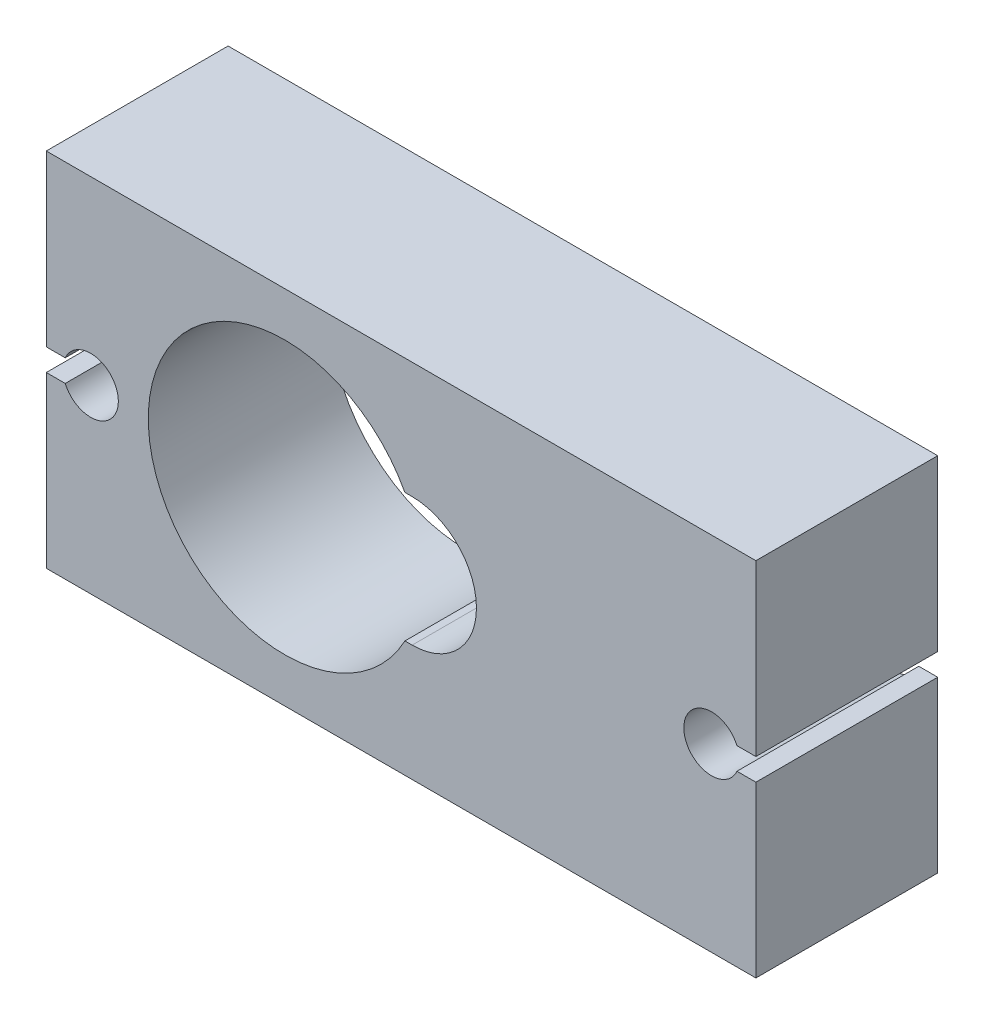
ISO-10303-21;
HEADER;
FILE_DESCRIPTION(('STEP AP214'),'2;1');
FILE_NAME('part.step','',(''),(''),'','','');
FILE_SCHEMA(('AUTOMOTIVE_DESIGN { 1 0 10303 214 1 1 1 1 }'));
ENDSEC;
DATA;
#1=APPLICATION_CONTEXT('core data for automotive mechanical design processes');
#2=APPLICATION_PROTOCOL_DEFINITION('international standard','automotive_design',2000,#1);
#3=PRODUCT_CONTEXT('',#1,'mechanical');
#4=PRODUCT('Part','Part','',(#3));
#5=PRODUCT_RELATED_PRODUCT_CATEGORY('part','',(#4));
#6=PRODUCT_DEFINITION_FORMATION('','',#4);
#7=PRODUCT_DEFINITION_CONTEXT('part definition',#1,'design');
#8=PRODUCT_DEFINITION('design','',#6,#7);
#9=PRODUCT_DEFINITION_SHAPE('','',#8);
#10=(LENGTH_UNIT() NAMED_UNIT(*) SI_UNIT(.MILLI.,.METRE.));
#11=(NAMED_UNIT(*) PLANE_ANGLE_UNIT() SI_UNIT($,.RADIAN.));
#12=(NAMED_UNIT(*) SI_UNIT($,.STERADIAN.) SOLID_ANGLE_UNIT());
#13=UNCERTAINTY_MEASURE_WITH_UNIT(LENGTH_MEASURE(1.E-05),#10,'distance_accuracy_value','');
#14=(GEOMETRIC_REPRESENTATION_CONTEXT(3) GLOBAL_UNCERTAINTY_ASSIGNED_CONTEXT((#13)) GLOBAL_UNIT_ASSIGNED_CONTEXT((#10,
#11,#12)) REPRESENTATION_CONTEXT('',''));
#15=CARTESIAN_POINT('',(0.,0.,0.));
#16=DIRECTION('',(0.,0.,1.));
#17=DIRECTION('',(1.,0.,0.));
#18=AXIS2_PLACEMENT_3D('',#15,#16,#17);
#19=CARTESIAN_POINT('',(-25.,5.74803322038159,8.2));
#20=DIRECTION('',(0.,0.,1.));
#21=DIRECTION('',(1.,0.,0.));
#22=AXIS2_PLACEMENT_3D('',#19,#20,#21);
#23=PLANE('',#22);
#24=CARTESIAN_POINT('',(-25.,5.74803322038159,8.2));
#25=DIRECTION('',(0.,0.,-1.));
#26=DIRECTION('',(1.,0.,0.));
#27=AXIS2_PLACEMENT_3D('',#24,#25,#26);
#28=CIRCLE('',#27,1.25);
#29=CARTESIAN_POINT('',(-26.145643923739,6.24803322038159,8.2));
#30=VERTEX_POINT('',#29);
#31=CARTESIAN_POINT('',(-26.145643923739,5.24803322038159,8.2));
#32=VERTEX_POINT('',#31);
#33=EDGE_CURVE('E182',#30,#32,#28,.T.);
#34=ORIENTED_EDGE('',*,*,#33,.T.);
#35=DIRECTION('',(-1.,0.,0.));
#36=VECTOR('',#35,1.);
#37=CARTESIAN_POINT('',(-26.145643923739,5.24803322038159,8.2));
#38=LINE('',#37,#36);
#39=CARTESIAN_POINT('',(-27.,5.24803322038159,8.2));
#40=VERTEX_POINT('',#39);
#41=EDGE_CURVE('E185',#32,#40,#38,.T.);
#42=ORIENTED_EDGE('',*,*,#41,.T.);
#43=DIRECTION('',(0.,-1.,0.));
#44=VECTOR('',#43,1.);
#45=CARTESIAN_POINT('',(-27.,5.24803322038159,8.2));
#46=LINE('',#45,#44);
#47=CARTESIAN_POINT('',(-27.,-2.4,8.2));
#48=VERTEX_POINT('',#47);
#49=EDGE_CURVE('E188',#40,#48,#46,.T.);
#50=ORIENTED_EDGE('',*,*,#49,.T.);
#51=DIRECTION('',(1.,0.,0.));
#52=VECTOR('',#51,1.);
#53=CARTESIAN_POINT('',(5.00280982172673,-2.4,8.2));
#54=LINE('',#53,#52);
#55=CARTESIAN_POINT('',(5.00280982172673,-2.4,8.2));
#56=VERTEX_POINT('',#55);
#57=EDGE_CURVE('E190',#48,#56,#54,.T.);
#58=ORIENTED_EDGE('',*,*,#57,.T.);
#59=DIRECTION('',(0.,1.,0.));
#60=VECTOR('',#59,1.);
#61=CARTESIAN_POINT('',(5.00280982172673,5.24803322038159,8.2));
#62=LINE('',#61,#60);
#63=CARTESIAN_POINT('',(5.00280982172673,5.24803322038159,8.2));
#64=VERTEX_POINT('',#63);
#65=EDGE_CURVE('E192',#56,#64,#62,.T.);
#66=ORIENTED_EDGE('',*,*,#65,.T.);
#67=DIRECTION('',(-1.,0.,0.));
#68=VECTOR('',#67,1.);
#69=CARTESIAN_POINT('',(5.00280982172673,5.24803322038159,8.2));
#70=LINE('',#69,#68);
#71=CARTESIAN_POINT('',(4.14845374546569,5.24803322038159,8.2));
#72=VERTEX_POINT('',#71);
#73=EDGE_CURVE('E194',#64,#72,#70,.T.);
#74=ORIENTED_EDGE('',*,*,#73,.T.);
#75=CARTESIAN_POINT('',(3.00280982172673,5.74803322038159,8.2));
#76=DIRECTION('',(0.,0.,-1.));
#77=DIRECTION('',(1.,0.,0.));
#78=AXIS2_PLACEMENT_3D('',#75,#76,#77);
#79=CIRCLE('',#78,1.25);
#80=CARTESIAN_POINT('',(4.14845374546569,6.24803322038159,8.2));
#81=VERTEX_POINT('',#80);
#82=EDGE_CURVE('E196',#72,#81,#79,.T.);
#83=ORIENTED_EDGE('',*,*,#82,.T.);
#84=DIRECTION('',(1.,0.,0.));
#85=VECTOR('',#84,1.);
#86=CARTESIAN_POINT('',(4.14845374546569,6.24803322038159,8.2));
#87=LINE('',#86,#85);
#88=CARTESIAN_POINT('',(5.00280982172672,6.24803322038159,8.2));
#89=VERTEX_POINT('',#88);
#90=EDGE_CURVE('E198',#81,#89,#87,.T.);
#91=ORIENTED_EDGE('',*,*,#90,.T.);
#92=DIRECTION('',(0.,1.,0.));
#93=VECTOR('',#92,1.);
#94=CARTESIAN_POINT('',(5.00280982172672,13.9,8.2));
#95=LINE('',#94,#93);
#96=CARTESIAN_POINT('',(5.00280982172672,13.9,8.2));
#97=VERTEX_POINT('',#96);
#98=EDGE_CURVE('E200',#89,#97,#95,.T.);
#99=ORIENTED_EDGE('',*,*,#98,.T.);
#100=DIRECTION('',(-1.,0.,0.));
#101=VECTOR('',#100,1.);
#102=CARTESIAN_POINT('',(-27.,13.9,8.2));
#103=LINE('',#102,#101);
#104=CARTESIAN_POINT('',(-27.,13.9,8.2));
#105=VERTEX_POINT('',#104);
#106=EDGE_CURVE('E202',#97,#105,#103,.T.);
#107=ORIENTED_EDGE('',*,*,#106,.T.);
#108=DIRECTION('',(0.,-1.,0.));
#109=VECTOR('',#108,1.);
#110=CARTESIAN_POINT('',(-27.,13.9,8.2));
#111=LINE('',#110,#109);
#112=CARTESIAN_POINT('',(-27.,6.24803322038159,8.2));
#113=VERTEX_POINT('',#112);
#114=EDGE_CURVE('E204',#105,#113,#111,.T.);
#115=ORIENTED_EDGE('',*,*,#114,.T.);
#116=DIRECTION('',(1.,0.,0.));
#117=VECTOR('',#116,1.);
#118=CARTESIAN_POINT('',(-27.,6.24803322038159,8.2));
#119=LINE('',#118,#117);
#120=EDGE_CURVE('E206',#113,#30,#119,.T.);
#121=ORIENTED_EDGE('',*,*,#120,.T.);
#122=EDGE_LOOP('',(#34,#42,#50,#58,#66,#74,#83,#91,#99,#107,#115,#121));
#123=FACE_BOUND('',#122,.T.);
#124=DIRECTION('',(-1.,0.,0.));
#125=VECTOR('',#124,1.);
#126=CARTESIAN_POINT('',(-10.5,8.65,8.2));
#127=LINE('',#126,#125);
#128=CARTESIAN_POINT('',(-10.5,8.65,8.2));
#129=VERTEX_POINT('',#128);
#130=CARTESIAN_POINT('',(-10.8266707641892,8.65,8.2));
#131=VERTEX_POINT('',#130);
#132=EDGE_CURVE('E154',#129,#131,#127,.T.);
#133=ORIENTED_EDGE('',*,*,#132,.F.);
#134=CARTESIAN_POINT('',(-10.5,5.75,8.2));
#135=DIRECTION('',(0.,0.,1.));
#136=DIRECTION('',(1.,0.,0.));
#137=AXIS2_PLACEMENT_3D('',#134,#135,#136);
#138=CIRCLE('',#137,2.9);
#139=CARTESIAN_POINT('',(-10.5,2.85,8.2));
#140=VERTEX_POINT('',#139);
#141=EDGE_CURVE('E146',#140,#129,#138,.T.);
#142=ORIENTED_EDGE('',*,*,#141,.F.);
#143=DIRECTION('',(1.,0.,0.));
#144=VECTOR('',#143,1.);
#145=CARTESIAN_POINT('',(-10.8266707641892,2.85,8.2));
#146=LINE('',#145,#144);
#147=CARTESIAN_POINT('',(-10.8266707641892,2.85,8.2));
#148=VERTEX_POINT('',#147);
#149=EDGE_CURVE('E168',#148,#140,#146,.T.);
#150=ORIENTED_EDGE('',*,*,#149,.F.);
#151=CARTESIAN_POINT('',(-16.25,5.75,8.2));
#152=DIRECTION('',(0.,0.,1.));
#153=DIRECTION('',(1.,0.,0.));
#154=AXIS2_PLACEMENT_3D('',#151,#152,#153);
#155=CIRCLE('',#154,6.15);
#156=EDGE_CURVE('E166',#131,#148,#155,.T.);
#157=ORIENTED_EDGE('',*,*,#156,.F.);
#158=EDGE_LOOP('',(#133,#142,#150,#157));
#159=FACE_BOUND('',#158,.T.);
#160=ADVANCED_FACE('F33',(#123,#159),#23,.T.);
#161=CARTESIAN_POINT('',(-25.,5.74803322038159,0.));
#162=DIRECTION('',(0.,0.,1.));
#163=DIRECTION('',(1.,0.,0.));
#164=AXIS2_PLACEMENT_3D('',#161,#162,#163);
#165=PLANE('',#164);
#166=CARTESIAN_POINT('',(-25.,5.74803322038159,0.));
#167=DIRECTION('',(0.,0.,-1.));
#168=DIRECTION('',(1.,0.,0.));
#169=AXIS2_PLACEMENT_3D('',#166,#167,#168);
#170=CIRCLE('',#169,1.25);
#171=CARTESIAN_POINT('',(-26.145643923739,6.24803322038159,0.));
#172=VERTEX_POINT('',#171);
#173=CARTESIAN_POINT('',(-26.145643923739,5.24803322038159,0.));
#174=VERTEX_POINT('',#173);
#175=EDGE_CURVE('E162',#172,#174,#170,.T.);
#176=ORIENTED_EDGE('',*,*,#175,.F.);
#177=DIRECTION('',(1.,0.,0.));
#178=VECTOR('',#177,1.);
#179=CARTESIAN_POINT('',(-27.,6.24803322038159,0.));
#180=LINE('',#179,#178);
#181=CARTESIAN_POINT('',(-27.,6.24803322038159,0.));
#182=VERTEX_POINT('',#181);
#183=EDGE_CURVE('E186',#182,#172,#180,.T.);
#184=ORIENTED_EDGE('',*,*,#183,.F.);
#185=DIRECTION('',(0.,-1.,0.));
#186=VECTOR('',#185,1.);
#187=CARTESIAN_POINT('',(-27.,13.9,0.));
#188=LINE('',#187,#186);
#189=CARTESIAN_POINT('',(-27.,13.9,0.));
#190=VERTEX_POINT('',#189);
#191=EDGE_CURVE('E229',#190,#182,#188,.T.);
#192=ORIENTED_EDGE('',*,*,#191,.F.);
#193=DIRECTION('',(-1.,0.,0.));
#194=VECTOR('',#193,1.);
#195=CARTESIAN_POINT('',(-27.,13.9,0.));
#196=LINE('',#195,#194);
#197=CARTESIAN_POINT('',(5.00280982172672,13.9,0.));
#198=VERTEX_POINT('',#197);
#199=EDGE_CURVE('E227',#198,#190,#196,.T.);
#200=ORIENTED_EDGE('',*,*,#199,.F.);
#201=DIRECTION('',(0.,1.,0.));
#202=VECTOR('',#201,1.);
#203=CARTESIAN_POINT('',(5.00280982172672,13.9,0.));
#204=LINE('',#203,#202);
#205=CARTESIAN_POINT('',(5.00280982172672,6.24803322038159,0.));
#206=VERTEX_POINT('',#205);
#207=EDGE_CURVE('E225',#206,#198,#204,.T.);
#208=ORIENTED_EDGE('',*,*,#207,.F.);
#209=DIRECTION('',(1.,0.,0.));
#210=VECTOR('',#209,1.);
#211=CARTESIAN_POINT('',(4.14845374546569,6.24803322038159,0.));
#212=LINE('',#211,#210);
#213=CARTESIAN_POINT('',(4.14845374546569,6.24803322038159,0.));
#214=VERTEX_POINT('',#213);
#215=EDGE_CURVE('E223',#214,#206,#212,.T.);
#216=ORIENTED_EDGE('',*,*,#215,.F.);
#217=CARTESIAN_POINT('',(3.00280982172673,5.74803322038159,0.));
#218=DIRECTION('',(0.,0.,-1.));
#219=DIRECTION('',(1.,0.,0.));
#220=AXIS2_PLACEMENT_3D('',#217,#218,#219);
#221=CIRCLE('',#220,1.25);
#222=CARTESIAN_POINT('',(4.14845374546569,5.24803322038159,0.));
#223=VERTEX_POINT('',#222);
#224=EDGE_CURVE('E221',#223,#214,#221,.T.);
#225=ORIENTED_EDGE('',*,*,#224,.F.);
#226=DIRECTION('',(-1.,0.,0.));
#227=VECTOR('',#226,1.);
#228=CARTESIAN_POINT('',(5.00280982172673,5.24803322038159,0.));
#229=LINE('',#228,#227);
#230=CARTESIAN_POINT('',(5.00280982172673,5.24803322038159,0.));
#231=VERTEX_POINT('',#230);
#232=EDGE_CURVE('E219',#231,#223,#229,.T.);
#233=ORIENTED_EDGE('',*,*,#232,.F.);
#234=DIRECTION('',(0.,1.,0.));
#235=VECTOR('',#234,1.);
#236=CARTESIAN_POINT('',(5.00280982172673,5.24803322038159,0.));
#237=LINE('',#236,#235);
#238=CARTESIAN_POINT('',(5.00280982172673,-2.4,0.));
#239=VERTEX_POINT('',#238);
#240=EDGE_CURVE('E217',#239,#231,#237,.T.);
#241=ORIENTED_EDGE('',*,*,#240,.F.);
#242=DIRECTION('',(1.,0.,0.));
#243=VECTOR('',#242,1.);
#244=CARTESIAN_POINT('',(5.00280982172673,-2.4,0.));
#245=LINE('',#244,#243);
#246=CARTESIAN_POINT('',(-27.,-2.4,0.));
#247=VERTEX_POINT('',#246);
#248=EDGE_CURVE('E215',#247,#239,#245,.T.);
#249=ORIENTED_EDGE('',*,*,#248,.F.);
#250=DIRECTION('',(0.,-1.,0.));
#251=VECTOR('',#250,1.);
#252=CARTESIAN_POINT('',(-27.,5.24803322038159,0.));
#253=LINE('',#252,#251);
#254=CARTESIAN_POINT('',(-27.,5.24803322038159,0.));
#255=VERTEX_POINT('',#254);
#256=EDGE_CURVE('E213',#255,#247,#253,.T.);
#257=ORIENTED_EDGE('',*,*,#256,.F.);
#258=DIRECTION('',(-1.,0.,0.));
#259=VECTOR('',#258,1.);
#260=CARTESIAN_POINT('',(-26.145643923739,5.24803322038159,0.));
#261=LINE('',#260,#259);
#262=EDGE_CURVE('E211',#174,#255,#261,.T.);
#263=ORIENTED_EDGE('',*,*,#262,.F.);
#264=EDGE_LOOP('',(#176,#184,#192,#200,#208,#216,#225,#233,#241,#249,#257,#263));
#265=FACE_BOUND('',#264,.T.);
#266=CARTESIAN_POINT('',(-10.5,5.75,0.));
#267=DIRECTION('',(0.,0.,1.));
#268=DIRECTION('',(1.,0.,0.));
#269=AXIS2_PLACEMENT_3D('',#266,#267,#268);
#270=CIRCLE('',#269,2.9);
#271=CARTESIAN_POINT('',(-10.5,2.85,0.));
#272=VERTEX_POINT('',#271);
#273=CARTESIAN_POINT('',(-10.5,8.65,0.));
#274=VERTEX_POINT('',#273);
#275=EDGE_CURVE('E56',#272,#274,#270,.T.);
#276=ORIENTED_EDGE('',*,*,#275,.T.);
#277=DIRECTION('',(-1.,0.,0.));
#278=VECTOR('',#277,1.);
#279=CARTESIAN_POINT('',(-10.5,8.65,0.));
#280=LINE('',#279,#278);
#281=CARTESIAN_POINT('',(-10.8266707641892,8.65,0.));
#282=VERTEX_POINT('',#281);
#283=EDGE_CURVE('E161',#274,#282,#280,.T.);
#284=ORIENTED_EDGE('',*,*,#283,.T.);
#285=CARTESIAN_POINT('',(-16.25,5.75,0.));
#286=DIRECTION('',(0.,0.,1.));
#287=DIRECTION('',(1.,0.,0.));
#288=AXIS2_PLACEMENT_3D('',#285,#286,#287);
#289=CIRCLE('',#288,6.15);
#290=CARTESIAN_POINT('',(-10.8266707641892,2.85,0.));
#291=VERTEX_POINT('',#290);
#292=EDGE_CURVE('E174',#282,#291,#289,.T.);
#293=ORIENTED_EDGE('',*,*,#292,.T.);
#294=DIRECTION('',(1.,0.,0.));
#295=VECTOR('',#294,1.);
#296=CARTESIAN_POINT('',(-10.8266707641892,2.85,0.));
#297=LINE('',#296,#295);
#298=EDGE_CURVE('E155',#291,#272,#297,.T.);
#299=ORIENTED_EDGE('',*,*,#298,.T.);
#300=EDGE_LOOP('',(#276,#284,#293,#299));
#301=FACE_BOUND('',#300,.T.);
#302=ADVANCED_FACE('F271',(#265,#301),#165,.F.);
#303=CARTESIAN_POINT('',(-25.,5.74803322038159,8.2));
#304=DIRECTION('',(0.,0.,-1.));
#305=DIRECTION('',(-1.,0.,0.));
#306=AXIS2_PLACEMENT_3D('',#303,#304,#305);
#307=CYLINDRICAL_SURFACE('',#306,1.25);
#308=ORIENTED_EDGE('',*,*,#175,.T.);
#309=DIRECTION('',(0.,0.,-1.));
#310=VECTOR('',#309,1.);
#311=CARTESIAN_POINT('',(-26.145643923739,5.24803322038159,8.2));
#312=LINE('',#311,#310);
#313=EDGE_CURVE('E11',#32,#174,#312,.T.);
#314=ORIENTED_EDGE('',*,*,#313,.F.);
#315=ORIENTED_EDGE('',*,*,#33,.F.);
#316=DIRECTION('',(0.,0.,-1.));
#317=VECTOR('',#316,1.);
#318=CARTESIAN_POINT('',(-26.145643923739,6.24803322038159,8.2));
#319=LINE('',#318,#317);
#320=EDGE_CURVE('E208',#30,#172,#319,.T.);
#321=ORIENTED_EDGE('',*,*,#320,.T.);
#322=EDGE_LOOP('',(#308,#314,#315,#321));
#323=FACE_BOUND('',#322,.T.);
#324=ADVANCED_FACE('F35',(#323),#307,.F.);
#325=CARTESIAN_POINT('',(-26.145643923739,5.24803322038159,8.2));
#326=DIRECTION('',(0.,-1.,0.));
#327=DIRECTION('',(0.,0.,-1.));
#328=AXIS2_PLACEMENT_3D('',#325,#326,#327);
#329=PLANE('',#328);
#330=ORIENTED_EDGE('',*,*,#262,.T.);
#331=DIRECTION('',(0.,0.,-1.));
#332=VECTOR('',#331,1.);
#333=CARTESIAN_POINT('',(-27.,5.24803322038159,8.2));
#334=LINE('',#333,#332);
#335=EDGE_CURVE('E41',#40,#255,#334,.T.);
#336=ORIENTED_EDGE('',*,*,#335,.F.);
#337=ORIENTED_EDGE('',*,*,#41,.F.);
#338=ORIENTED_EDGE('',*,*,#313,.T.);
#339=EDGE_LOOP('',(#330,#336,#337,#338));
#340=FACE_BOUND('',#339,.T.);
#341=ADVANCED_FACE('F288',(#340),#329,.F.);
#342=CARTESIAN_POINT('',(-27.,5.24803322038159,8.2));
#343=DIRECTION('',(1.,0.,0.));
#344=DIRECTION('',(0.,0.,-1.));
#345=AXIS2_PLACEMENT_3D('',#342,#343,#344);
#346=PLANE('',#345);
#347=ORIENTED_EDGE('',*,*,#256,.T.);
#348=DIRECTION('',(0.,0.,-1.));
#349=VECTOR('',#348,1.);
#350=CARTESIAN_POINT('',(-27.,-2.4,8.2));
#351=LINE('',#350,#349);
#352=EDGE_CURVE('E258',#48,#247,#351,.T.);
#353=ORIENTED_EDGE('',*,*,#352,.F.);
#354=ORIENTED_EDGE('',*,*,#49,.F.);
#355=ORIENTED_EDGE('',*,*,#335,.T.);
#356=EDGE_LOOP('',(#347,#353,#354,#355));
#357=FACE_BOUND('',#356,.T.);
#358=ADVANCED_FACE('F265',(#357),#346,.F.);
#359=CARTESIAN_POINT('',(5.00280982172673,-2.4,8.2));
#360=DIRECTION('',(0.,1.,0.));
#361=DIRECTION('',(-1.,0.,0.));
#362=AXIS2_PLACEMENT_3D('',#359,#360,#361);
#363=PLANE('',#362);
#364=ORIENTED_EDGE('',*,*,#248,.T.);
#365=DIRECTION('',(0.,0.,-1.));
#366=VECTOR('',#365,1.);
#367=CARTESIAN_POINT('',(5.00280982172673,-2.4,8.2));
#368=LINE('',#367,#366);
#369=EDGE_CURVE('E255',#56,#239,#368,.T.);
#370=ORIENTED_EDGE('',*,*,#369,.F.);
#371=ORIENTED_EDGE('',*,*,#57,.F.);
#372=ORIENTED_EDGE('',*,*,#352,.T.);
#373=EDGE_LOOP('',(#364,#370,#371,#372));
#374=FACE_BOUND('',#373,.T.);
#375=ADVANCED_FACE('F277',(#374),#363,.F.);
#376=CARTESIAN_POINT('',(5.00280982172673,5.24803322038159,8.2));
#377=DIRECTION('',(-1.,0.,0.));
#378=DIRECTION('',(0.,-1.,0.));
#379=AXIS2_PLACEMENT_3D('',#376,#377,#378);
#380=PLANE('',#379);
#381=ORIENTED_EDGE('',*,*,#240,.T.);
#382=DIRECTION('',(0.,0.,-1.));
#383=VECTOR('',#382,1.);
#384=CARTESIAN_POINT('',(5.00280982172673,5.24803322038159,8.2));
#385=LINE('',#384,#383);
#386=EDGE_CURVE('E252',#64,#231,#385,.T.);
#387=ORIENTED_EDGE('',*,*,#386,.F.);
#388=ORIENTED_EDGE('',*,*,#65,.F.);
#389=ORIENTED_EDGE('',*,*,#369,.T.);
#390=EDGE_LOOP('',(#381,#387,#388,#389));
#391=FACE_BOUND('',#390,.T.);
#392=ADVANCED_FACE('F281',(#391),#380,.F.);
#393=CARTESIAN_POINT('',(5.00280982172673,5.24803322038159,8.2));
#394=DIRECTION('',(0.,-1.,0.));
#395=DIRECTION('',(1.,0.,0.));
#396=AXIS2_PLACEMENT_3D('',#393,#394,#395);
#397=PLANE('',#396);
#398=ORIENTED_EDGE('',*,*,#232,.T.);
#399=DIRECTION('',(0.,0.,-1.));
#400=VECTOR('',#399,1.);
#401=CARTESIAN_POINT('',(4.14845374546569,5.24803322038159,8.2));
#402=LINE('',#401,#400);
#403=EDGE_CURVE('E249',#72,#223,#402,.T.);
#404=ORIENTED_EDGE('',*,*,#403,.F.);
#405=ORIENTED_EDGE('',*,*,#73,.F.);
#406=ORIENTED_EDGE('',*,*,#386,.T.);
#407=EDGE_LOOP('',(#398,#404,#405,#406));
#408=FACE_BOUND('',#407,.T.);
#409=ADVANCED_FACE('F321',(#408),#397,.F.);
#410=CARTESIAN_POINT('',(3.00280982172673,5.74803322038159,8.2));
#411=DIRECTION('',(0.,0.,-1.));
#412=DIRECTION('',(-1.,0.,0.));
#413=AXIS2_PLACEMENT_3D('',#410,#411,#412);
#414=CYLINDRICAL_SURFACE('',#413,1.25);
#415=ORIENTED_EDGE('',*,*,#224,.T.);
#416=DIRECTION('',(0.,0.,-1.));
#417=VECTOR('',#416,1.);
#418=CARTESIAN_POINT('',(4.14845374546569,6.24803322038159,8.2));
#419=LINE('',#418,#417);
#420=EDGE_CURVE('E246',#81,#214,#419,.T.);
#421=ORIENTED_EDGE('',*,*,#420,.F.);
#422=ORIENTED_EDGE('',*,*,#82,.F.);
#423=ORIENTED_EDGE('',*,*,#403,.T.);
#424=EDGE_LOOP('',(#415,#421,#422,#423));
#425=FACE_BOUND('',#424,.T.);
#426=ADVANCED_FACE('F319',(#425),#414,.F.);
#427=CARTESIAN_POINT('',(4.14845374546569,6.24803322038159,8.2));
#428=DIRECTION('',(0.,1.,0.));
#429=DIRECTION('',(0.,0.,1.));
#430=AXIS2_PLACEMENT_3D('',#427,#428,#429);
#431=PLANE('',#430);
#432=ORIENTED_EDGE('',*,*,#215,.T.);
#433=DIRECTION('',(0.,0.,-1.));
#434=VECTOR('',#433,1.);
#435=CARTESIAN_POINT('',(5.00280982172672,6.24803322038159,8.2));
#436=LINE('',#435,#434);
#437=EDGE_CURVE('E243',#89,#206,#436,.T.);
#438=ORIENTED_EDGE('',*,*,#437,.F.);
#439=ORIENTED_EDGE('',*,*,#90,.F.);
#440=ORIENTED_EDGE('',*,*,#420,.T.);
#441=EDGE_LOOP('',(#432,#438,#439,#440));
#442=FACE_BOUND('',#441,.T.);
#443=ADVANCED_FACE('F315',(#442),#431,.F.);
#444=CARTESIAN_POINT('',(5.00280982172672,13.9,8.2));
#445=DIRECTION('',(-1.,0.,0.));
#446=DIRECTION('',(0.,0.,1.));
#447=AXIS2_PLACEMENT_3D('',#444,#445,#446);
#448=PLANE('',#447);
#449=ORIENTED_EDGE('',*,*,#207,.T.);
#450=DIRECTION('',(0.,0.,-1.));
#451=VECTOR('',#450,1.);
#452=CARTESIAN_POINT('',(5.00280982172672,13.9,8.2));
#453=LINE('',#452,#451);
#454=EDGE_CURVE('E240',#97,#198,#453,.T.);
#455=ORIENTED_EDGE('',*,*,#454,.F.);
#456=ORIENTED_EDGE('',*,*,#98,.F.);
#457=ORIENTED_EDGE('',*,*,#437,.T.);
#458=EDGE_LOOP('',(#449,#455,#456,#457));
#459=FACE_BOUND('',#458,.T.);
#460=ADVANCED_FACE('F310',(#459),#448,.F.);
#461=CARTESIAN_POINT('',(-27.,13.9,8.2));
#462=DIRECTION('',(0.,-1.,0.));
#463=DIRECTION('',(0.,0.,-1.));
#464=AXIS2_PLACEMENT_3D('',#461,#462,#463);
#465=PLANE('',#464);
#466=ORIENTED_EDGE('',*,*,#199,.T.);
#467=DIRECTION('',(0.,0.,-1.));
#468=VECTOR('',#467,1.);
#469=CARTESIAN_POINT('',(-27.,13.9,8.2));
#470=LINE('',#469,#468);
#471=EDGE_CURVE('E237',#105,#190,#470,.T.);
#472=ORIENTED_EDGE('',*,*,#471,.F.);
#473=ORIENTED_EDGE('',*,*,#106,.F.);
#474=ORIENTED_EDGE('',*,*,#454,.T.);
#475=EDGE_LOOP('',(#466,#472,#473,#474));
#476=FACE_BOUND('',#475,.T.);
#477=ADVANCED_FACE('F304',(#476),#465,.F.);
#478=CARTESIAN_POINT('',(-27.,13.9,8.2));
#479=DIRECTION('',(1.,0.,0.));
#480=DIRECTION('',(0.,0.,-1.));
#481=AXIS2_PLACEMENT_3D('',#478,#479,#480);
#482=PLANE('',#481);
#483=ORIENTED_EDGE('',*,*,#191,.T.);
#484=DIRECTION('',(0.,0.,-1.));
#485=VECTOR('',#484,1.);
#486=CARTESIAN_POINT('',(-27.,6.24803322038159,8.2));
#487=LINE('',#486,#485);
#488=EDGE_CURVE('E234',#113,#182,#487,.T.);
#489=ORIENTED_EDGE('',*,*,#488,.F.);
#490=ORIENTED_EDGE('',*,*,#114,.F.);
#491=ORIENTED_EDGE('',*,*,#471,.T.);
#492=EDGE_LOOP('',(#483,#489,#490,#491));
#493=FACE_BOUND('',#492,.T.);
#494=ADVANCED_FACE('F300',(#493),#482,.F.);
#495=CARTESIAN_POINT('',(-27.,6.24803322038159,8.2));
#496=DIRECTION('',(0.,1.,0.));
#497=DIRECTION('',(0.,0.,1.));
#498=AXIS2_PLACEMENT_3D('',#495,#496,#497);
#499=PLANE('',#498);
#500=ORIENTED_EDGE('',*,*,#183,.T.);
#501=ORIENTED_EDGE('',*,*,#320,.F.);
#502=ORIENTED_EDGE('',*,*,#120,.F.);
#503=ORIENTED_EDGE('',*,*,#488,.T.);
#504=EDGE_LOOP('',(#500,#501,#502,#503));
#505=FACE_BOUND('',#504,.T.);
#506=ADVANCED_FACE('F295',(#505),#499,.F.);
#507=CARTESIAN_POINT('',(-10.5,5.75,8.2));
#508=DIRECTION('',(0.,0.,-1.));
#509=DIRECTION('',(-1.,0.,0.));
#510=AXIS2_PLACEMENT_3D('',#507,#508,#509);
#511=CYLINDRICAL_SURFACE('',#510,2.9);
#512=ORIENTED_EDGE('',*,*,#275,.F.);
#513=DIRECTION('',(0.,0.,-1.));
#514=VECTOR('',#513,1.);
#515=CARTESIAN_POINT('',(-10.5,2.85,8.2));
#516=LINE('',#515,#514);
#517=EDGE_CURVE('E150',#140,#272,#516,.T.);
#518=ORIENTED_EDGE('',*,*,#517,.F.);
#519=ORIENTED_EDGE('',*,*,#141,.T.);
#520=DIRECTION('',(0.,0.,-1.));
#521=VECTOR('',#520,1.);
#522=CARTESIAN_POINT('',(-10.5,8.65,8.2));
#523=LINE('',#522,#521);
#524=EDGE_CURVE('E149',#129,#274,#523,.T.);
#525=ORIENTED_EDGE('',*,*,#524,.T.);
#526=EDGE_LOOP('',(#512,#518,#519,#525));
#527=FACE_BOUND('',#526,.T.);
#528=ADVANCED_FACE('F148',(#527),#511,.F.);
#529=CARTESIAN_POINT('',(-10.5,8.65,8.2));
#530=DIRECTION('',(0.,-1.,0.));
#531=DIRECTION('',(1.,0.,0.));
#532=AXIS2_PLACEMENT_3D('',#529,#530,#531);
#533=PLANE('',#532);
#534=ORIENTED_EDGE('',*,*,#283,.F.);
#535=ORIENTED_EDGE('',*,*,#524,.F.);
#536=ORIENTED_EDGE('',*,*,#132,.T.);
#537=DIRECTION('',(0.,0.,-1.));
#538=VECTOR('',#537,1.);
#539=CARTESIAN_POINT('',(-10.8266707641892,8.65,8.2));
#540=LINE('',#539,#538);
#541=EDGE_CURVE('E163',#131,#282,#540,.T.);
#542=ORIENTED_EDGE('',*,*,#541,.T.);
#543=EDGE_LOOP('',(#534,#535,#536,#542));
#544=FACE_BOUND('',#543,.T.);
#545=ADVANCED_FACE('F158',(#544),#533,.T.);
#546=CARTESIAN_POINT('',(-16.25,5.75,8.2));
#547=DIRECTION('',(0.,0.,-1.));
#548=DIRECTION('',(-1.,0.,0.));
#549=AXIS2_PLACEMENT_3D('',#546,#547,#548);
#550=CYLINDRICAL_SURFACE('',#549,6.15);
#551=ORIENTED_EDGE('',*,*,#292,.F.);
#552=ORIENTED_EDGE('',*,*,#541,.F.);
#553=ORIENTED_EDGE('',*,*,#156,.T.);
#554=DIRECTION('',(0.,0.,-1.));
#555=VECTOR('',#554,1.);
#556=CARTESIAN_POINT('',(-10.8266707641892,2.85,8.2));
#557=LINE('',#556,#555);
#558=EDGE_CURVE('E48',#148,#291,#557,.T.);
#559=ORIENTED_EDGE('',*,*,#558,.T.);
#560=EDGE_LOOP('',(#551,#552,#553,#559));
#561=FACE_BOUND('',#560,.T.);
#562=ADVANCED_FACE('F379',(#561),#550,.F.);
#563=CARTESIAN_POINT('',(-10.8266707641892,2.85,8.2));
#564=DIRECTION('',(0.,1.,0.));
#565=DIRECTION('',(-1.,0.,0.));
#566=AXIS2_PLACEMENT_3D('',#563,#564,#565);
#567=PLANE('',#566);
#568=ORIENTED_EDGE('',*,*,#298,.F.);
#569=ORIENTED_EDGE('',*,*,#558,.F.);
#570=ORIENTED_EDGE('',*,*,#149,.T.);
#571=ORIENTED_EDGE('',*,*,#517,.T.);
#572=EDGE_LOOP('',(#568,#569,#570,#571));
#573=FACE_BOUND('',#572,.T.);
#574=ADVANCED_FACE('F385',(#573),#567,.T.);
#575=CLOSED_SHELL('',(#160,#302,#324,#341,#358,#375,#392,#409,#426,#443,#460,#477,#494,#506,
#528,#545,#562,#574));
#576=MANIFOLD_SOLID_BREP('B2',#575);
#577=ADVANCED_BREP_SHAPE_REPRESENTATION('',(#18,#576),#14);
#578=SHAPE_DEFINITION_REPRESENTATION(#9,#577);
ENDSEC;
END-ISO-10303-21;
